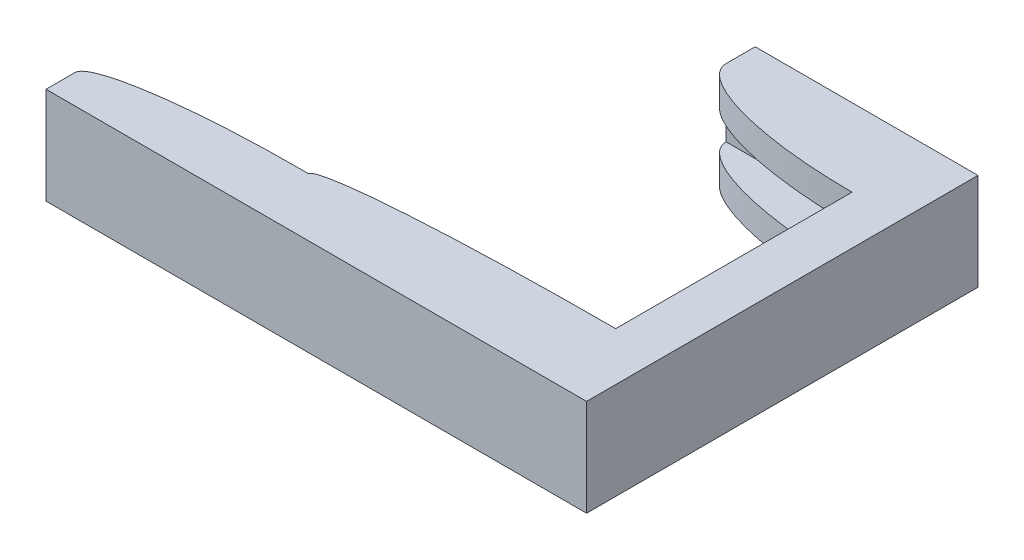
ISO-10303-21;
HEADER;
FILE_DESCRIPTION(('STEP AP214'),'2;1');
FILE_NAME('part.step','',(''),(''),'','','');
FILE_SCHEMA(('AUTOMOTIVE_DESIGN { 1 0 10303 214 1 1 1 1 }'));
ENDSEC;
DATA;
#1=APPLICATION_CONTEXT('core data for automotive mechanical design processes');
#2=APPLICATION_PROTOCOL_DEFINITION('international standard','automotive_design',2000,#1);
#3=PRODUCT_CONTEXT('',#1,'mechanical');
#4=PRODUCT('Part','Part','',(#3));
#5=PRODUCT_RELATED_PRODUCT_CATEGORY('part','',(#4));
#6=PRODUCT_DEFINITION_FORMATION('','',#4);
#7=PRODUCT_DEFINITION_CONTEXT('part definition',#1,'design');
#8=PRODUCT_DEFINITION('design','',#6,#7);
#9=PRODUCT_DEFINITION_SHAPE('','',#8);
#10=(LENGTH_UNIT() NAMED_UNIT(*) SI_UNIT(.MILLI.,.METRE.));
#11=(NAMED_UNIT(*) PLANE_ANGLE_UNIT() SI_UNIT($,.RADIAN.));
#12=(NAMED_UNIT(*) SI_UNIT($,.STERADIAN.) SOLID_ANGLE_UNIT());
#13=UNCERTAINTY_MEASURE_WITH_UNIT(LENGTH_MEASURE(1.E-05),#10,'distance_accuracy_value','');
#14=(GEOMETRIC_REPRESENTATION_CONTEXT(3) GLOBAL_UNCERTAINTY_ASSIGNED_CONTEXT((#13)) GLOBAL_UNIT_ASSIGNED_CONTEXT((#10,
#11,#12)) REPRESENTATION_CONTEXT('',''));
#15=CARTESIAN_POINT('',(0.,0.,0.));
#16=DIRECTION('',(0.,0.,1.));
#17=DIRECTION('',(1.,0.,0.));
#18=AXIS2_PLACEMENT_3D('',#15,#16,#17);
#19=CARTESIAN_POINT('',(-59.2757644968321,-0.15,32.3090395358832));
#20=CARTESIAN_POINT('',(-59.2757644968321,0.450000000000001,32.3090395358832));
#21=CARTESIAN_POINT('',(-59.2757644968321,1.05,32.3090395358832));
#22=CARTESIAN_POINT('',(-59.2757644968321,1.65,32.3090395358832));
#23=CARTESIAN_POINT('',(-69.2757644968321,-0.15,32.3090395358832));
#24=CARTESIAN_POINT('',(-69.2757644968321,0.45,32.3090395358832));
#25=CARTESIAN_POINT('',(-69.2757644968321,1.05,32.3090395358832));
#26=CARTESIAN_POINT('',(-69.2757644968321,1.65,32.3090395358832));
#27=CARTESIAN_POINT('',(-69.2757644968321,-0.15,33.8090395358832));
#28=CARTESIAN_POINT('',(-69.2757644968321,0.450000000000001,33.8090395358832));
#29=CARTESIAN_POINT('',(-69.2757644968321,1.05,33.8090395358832));
#30=CARTESIAN_POINT('',(-69.2757644968321,1.65,33.8090395358832));
#31=(BOUNDED_SURFACE() B_SPLINE_SURFACE(2,3,((#19,#20,#21,#22),(#23,#24,#25,#26),(#27,#28,#29,
#30)),.UNSPECIFIED.,.F.,.F.,.F.) B_SPLINE_SURFACE_WITH_KNOTS((3,3),(4,4),(0.,1.),(-0.00015,
0.00165),.UNSPECIFIED.) GEOMETRIC_REPRESENTATION_ITEM() RATIONAL_B_SPLINE_SURFACE(((1.,1.,1.,
1.),(0.707106781186548,0.707106781186548,0.707106781186548,0.707106781186548),(1.,1.,1.,1.))) REPRESENTATION_ITEM('') SURFACE());
#32=CARTESIAN_POINT('',(-59.2757644968321,1.65,32.3090395358832));
#33=CARTESIAN_POINT('',(-59.2757644968321,1.05,32.3090395358832));
#34=CARTESIAN_POINT('',(-59.2757644968321,0.450000000000001,32.3090395358832));
#35=CARTESIAN_POINT('',(-59.2757644968321,-0.15,32.3090395358832));
#36=(BOUNDED_CURVE() B_SPLINE_CURVE(3,(#32,#33,#34,#35),.UNSPECIFIED.,.F.,
.F.) B_SPLINE_CURVE_WITH_KNOTS((4,4),(-0.00015,0.00165),
.UNSPECIFIED.) CURVE() GEOMETRIC_REPRESENTATION_ITEM() RATIONAL_B_SPLINE_CURVE((1.,1.,1.,1.)) REPRESENTATION_ITEM(''));
#37=CARTESIAN_POINT('',(-59.2757644968321,0.,32.3090395358832));
#38=VERTEX_POINT('',#37);
#39=CARTESIAN_POINT('',(-59.2757644968321,1.5,32.3090395358832));
#40=VERTEX_POINT('',#39);
#41=EDGE_CURVE('E393',#38,#40,#36,.F.);
#42=CARTESIAN_POINT('',(-59.2757644968321,0.,32.3090395358832));
#43=CARTESIAN_POINT('',(-69.2757644968321,0.,32.3090395358832));
#44=CARTESIAN_POINT('',(-69.2757644968321,0.,33.8090395358832));
#45=(BOUNDED_CURVE() B_SPLINE_CURVE(2,(#42,#43,#44),.UNSPECIFIED.,.F.,
.F.) B_SPLINE_CURVE_WITH_KNOTS((3,3),(0.,1.),
.UNSPECIFIED.) CURVE() GEOMETRIC_REPRESENTATION_ITEM() RATIONAL_B_SPLINE_CURVE((1.,
0.707106781186548,1.)) REPRESENTATION_ITEM(''));
#46=CARTESIAN_POINT('',(-69.2757644968321,0.,33.8090395358832));
#47=VERTEX_POINT('',#46);
#48=EDGE_CURVE('E51',#47,#38,#45,.F.);
#49=CARTESIAN_POINT('',(-69.2757644968321,-0.15,33.8090395358832));
#50=CARTESIAN_POINT('',(-69.2757644968321,0.450000000000001,33.8090395358832));
#51=CARTESIAN_POINT('',(-69.2757644968321,1.05,33.8090395358832));
#52=CARTESIAN_POINT('',(-69.2757644968321,1.65,33.8090395358832));
#53=(BOUNDED_CURVE() B_SPLINE_CURVE(3,(#49,#50,#51,#52),.UNSPECIFIED.,.F.,
.F.) B_SPLINE_CURVE_WITH_KNOTS((4,4),(-0.00015,0.00165),
.UNSPECIFIED.) CURVE() GEOMETRIC_REPRESENTATION_ITEM() RATIONAL_B_SPLINE_CURVE((1.,1.,1.,1.)) REPRESENTATION_ITEM(''));
#54=CARTESIAN_POINT('',(-69.2757644968321,1.5,33.8090395358832));
#55=VERTEX_POINT('',#54);
#56=EDGE_CURVE('E404',#55,#47,#53,.F.);
#57=CARTESIAN_POINT('',(-69.2757644968321,1.5,33.8090395358832));
#58=CARTESIAN_POINT('',(-69.2757644968321,1.5,32.3090395358832));
#59=CARTESIAN_POINT('',(-59.2757644968321,1.5,32.3090395358832));
#60=(BOUNDED_CURVE() B_SPLINE_CURVE(2,(#57,#58,#59),.UNSPECIFIED.,.F.,
.F.) B_SPLINE_CURVE_WITH_KNOTS((3,3),(0.,1.),
.UNSPECIFIED.) CURVE() GEOMETRIC_REPRESENTATION_ITEM() RATIONAL_B_SPLINE_CURVE((1.,
0.707106781186547,1.)) REPRESENTATION_ITEM(''));
#61=EDGE_CURVE('E12',#40,#55,#60,.F.);
#62=ORIENTED_EDGE('',*,*,#41,.F.);
#63=ORIENTED_EDGE('',*,*,#48,.F.);
#64=ORIENTED_EDGE('',*,*,#56,.F.);
#65=ORIENTED_EDGE('',*,*,#61,.F.);
#66=EDGE_LOOP('',(#62,#63,#64,#65));
#67=FACE_BOUND('',#66,.T.);
#68=ADVANCED_FACE('F38',(#67),#31,.T.);
#69=CARTESIAN_POINT('',(-59.2757644968321,3.35,32.3090395358832));
#70=CARTESIAN_POINT('',(-59.2757644968321,3.95,32.3090395358832));
#71=CARTESIAN_POINT('',(-59.2757644968321,4.55,32.3090395358832));
#72=CARTESIAN_POINT('',(-59.2757644968321,5.15,32.3090395358832));
#73=CARTESIAN_POINT('',(-69.2757644968321,3.35,32.3090395358832));
#74=CARTESIAN_POINT('',(-69.2757644968321,3.95,32.3090395358832));
#75=CARTESIAN_POINT('',(-69.2757644968321,4.55,32.3090395358832));
#76=CARTESIAN_POINT('',(-69.2757644968321,5.15,32.3090395358832));
#77=CARTESIAN_POINT('',(-69.2757644968321,3.35,33.8090395358832));
#78=CARTESIAN_POINT('',(-69.2757644968321,3.95,33.8090395358832));
#79=CARTESIAN_POINT('',(-69.2757644968321,4.55,33.8090395358832));
#80=CARTESIAN_POINT('',(-69.2757644968321,5.15,33.8090395358832));
#81=(BOUNDED_SURFACE() B_SPLINE_SURFACE(2,3,((#69,#70,#71,#72),(#73,#74,#75,#76),(#77,#78,#79,
#80)),.UNSPECIFIED.,.F.,.F.,.F.) B_SPLINE_SURFACE_WITH_KNOTS((3,3),(4,4),(0.,1.),(0.00335,
0.00515),.UNSPECIFIED.) GEOMETRIC_REPRESENTATION_ITEM() RATIONAL_B_SPLINE_SURFACE(((1.,1.,1.,
1.),(0.707106781186548,0.707106781186548,0.707106781186548,0.707106781186548),(1.,1.,1.,1.))) REPRESENTATION_ITEM('') SURFACE());
#82=CARTESIAN_POINT('',(-59.2757644968321,5.15,32.3090395358832));
#83=CARTESIAN_POINT('',(-59.2757644968321,4.55,32.3090395358832));
#84=CARTESIAN_POINT('',(-59.2757644968321,3.95,32.3090395358832));
#85=CARTESIAN_POINT('',(-59.2757644968321,3.35,32.3090395358832));
#86=(BOUNDED_CURVE() B_SPLINE_CURVE(3,(#82,#83,#84,#85),.UNSPECIFIED.,.F.,
.F.) B_SPLINE_CURVE_WITH_KNOTS((4,4),(0.00335,0.00515),
.UNSPECIFIED.) CURVE() GEOMETRIC_REPRESENTATION_ITEM() RATIONAL_B_SPLINE_CURVE((1.,1.,1.,1.)) REPRESENTATION_ITEM(''));
#87=CARTESIAN_POINT('',(-59.2757644968321,3.5,32.3090395358832));
#88=VERTEX_POINT('',#87);
#89=CARTESIAN_POINT('',(-59.2757644968321,5.,32.3090395358832));
#90=VERTEX_POINT('',#89);
#91=EDGE_CURVE('E431',#88,#90,#86,.F.);
#92=CARTESIAN_POINT('',(-59.2757644968321,3.5,32.3090395358832));
#93=CARTESIAN_POINT('',(-69.2757644968321,3.5,32.3090395358832));
#94=CARTESIAN_POINT('',(-69.2757644968321,3.5,33.8090395358832));
#95=(BOUNDED_CURVE() B_SPLINE_CURVE(2,(#92,#93,#94),.UNSPECIFIED.,.F.,
.F.) B_SPLINE_CURVE_WITH_KNOTS((3,3),(0.,1.),
.UNSPECIFIED.) CURVE() GEOMETRIC_REPRESENTATION_ITEM() RATIONAL_B_SPLINE_CURVE((1.,
0.707106781186548,1.)) REPRESENTATION_ITEM(''));
#96=CARTESIAN_POINT('',(-69.2757644968321,3.5,33.8090395358832));
#97=VERTEX_POINT('',#96);
#98=EDGE_CURVE('E769',#97,#88,#95,.F.);
#99=CARTESIAN_POINT('',(-69.2757644968321,3.35,33.8090395358832));
#100=CARTESIAN_POINT('',(-69.2757644968321,3.95,33.8090395358832));
#101=CARTESIAN_POINT('',(-69.2757644968321,4.55,33.8090395358832));
#102=CARTESIAN_POINT('',(-69.2757644968321,5.15,33.8090395358832));
#103=(BOUNDED_CURVE() B_SPLINE_CURVE(3,(#99,#100,#101,#102),.UNSPECIFIED.,.F.,
.F.) B_SPLINE_CURVE_WITH_KNOTS((4,4),(0.00335,0.00515),
.UNSPECIFIED.) CURVE() GEOMETRIC_REPRESENTATION_ITEM() RATIONAL_B_SPLINE_CURVE((1.,1.,1.,1.)) REPRESENTATION_ITEM(''));
#104=CARTESIAN_POINT('',(-69.2757644968321,5.,33.8090395358832));
#105=VERTEX_POINT('',#104);
#106=EDGE_CURVE('E758',#105,#97,#103,.F.);
#107=CARTESIAN_POINT('',(-69.2757644968321,5.,33.8090395358832));
#108=CARTESIAN_POINT('',(-69.2757644968321,5.,32.3090395358832));
#109=CARTESIAN_POINT('',(-59.2757644968321,5.,32.3090395358832));
#110=(BOUNDED_CURVE() B_SPLINE_CURVE(2,(#107,#108,#109),.UNSPECIFIED.,.F.,
.F.) B_SPLINE_CURVE_WITH_KNOTS((3,3),(0.,1.),
.UNSPECIFIED.) CURVE() GEOMETRIC_REPRESENTATION_ITEM() RATIONAL_B_SPLINE_CURVE((1.,
0.707106781186548,1.)) REPRESENTATION_ITEM(''));
#111=EDGE_CURVE('E423',#90,#105,#110,.F.);
#112=ORIENTED_EDGE('',*,*,#91,.F.);
#113=ORIENTED_EDGE('',*,*,#98,.F.);
#114=ORIENTED_EDGE('',*,*,#106,.F.);
#115=ORIENTED_EDGE('',*,*,#111,.F.);
#116=EDGE_LOOP('',(#112,#113,#114,#115));
#117=FACE_BOUND('',#116,.T.);
#118=ADVANCED_FACE('F464',(#117),#81,.T.);
#119=CARTESIAN_POINT('',(-44.2198376061391,-0.15,31.3090395358832));
#120=CARTESIAN_POINT('',(-44.2198376061391,0.450000000000001,31.3090395358832));
#121=CARTESIAN_POINT('',(-44.2198376061391,1.05,31.3090395358832));
#122=CARTESIAN_POINT('',(-44.2198376061391,1.65,31.3090395358832));
#123=CARTESIAN_POINT('',(-58.7198376061391,-0.15,31.3090395358831));
#124=CARTESIAN_POINT('',(-58.7198376061391,0.45,31.3090395358831));
#125=CARTESIAN_POINT('',(-58.7198376061391,1.05,31.3090395358831));
#126=CARTESIAN_POINT('',(-58.7198376061391,1.65,31.3090395358831));
#127=CARTESIAN_POINT('',(-58.7198376061391,-0.15,32.3090395358832));
#128=CARTESIAN_POINT('',(-58.7198376061391,0.450000000000001,32.3090395358832));
#129=CARTESIAN_POINT('',(-58.7198376061391,1.05,32.3090395358832));
#130=CARTESIAN_POINT('',(-58.7198376061391,1.65,32.3090395358832));
#131=(BOUNDED_SURFACE() B_SPLINE_SURFACE(2,3,((#119,#120,#121,#122),(#123,#124,#125,#126),(#127,
#128,#129,#130)),.UNSPECIFIED.,.F.,.F.,.F.) B_SPLINE_SURFACE_WITH_KNOTS((3,3),(4,4),(0.,1.),
(-0.00015,0.00165),
.UNSPECIFIED.) GEOMETRIC_REPRESENTATION_ITEM() RATIONAL_B_SPLINE_SURFACE(((1.,1.,1.,1.),
(0.707106781186545,0.707106781186545,0.707106781186545,0.707106781186545),(1.,1.,1.,1.))) REPRESENTATION_ITEM('') SURFACE());
#132=CARTESIAN_POINT('',(-44.2198376061391,1.65,31.3090395358832));
#133=CARTESIAN_POINT('',(-44.2198376061391,1.05,31.3090395358832));
#134=CARTESIAN_POINT('',(-44.2198376061391,0.450000000000001,31.3090395358832));
#135=CARTESIAN_POINT('',(-44.2198376061391,-0.15,31.3090395358832));
#136=(BOUNDED_CURVE() B_SPLINE_CURVE(3,(#132,#133,#134,#135),.UNSPECIFIED.,.F.,
.F.) B_SPLINE_CURVE_WITH_KNOTS((4,4),(-0.00015,0.00165),
.UNSPECIFIED.) CURVE() GEOMETRIC_REPRESENTATION_ITEM() RATIONAL_B_SPLINE_CURVE((1.,1.,1.,1.)) REPRESENTATION_ITEM(''));
#137=CARTESIAN_POINT('',(-44.2198376061391,0.,31.3090395358832));
#138=VERTEX_POINT('',#137);
#139=CARTESIAN_POINT('',(-44.2198376061391,1.5,31.3090395358832));
#140=VERTEX_POINT('',#139);
#141=EDGE_CURVE('E674',#138,#140,#136,.F.);
#142=CARTESIAN_POINT('',(-44.2198376061391,0.,31.3090395358832));
#143=CARTESIAN_POINT('',(-58.7198376061391,0.,31.3090395358831));
#144=CARTESIAN_POINT('',(-58.7198376061391,0.,32.3090395358832));
#145=(BOUNDED_CURVE() B_SPLINE_CURVE(2,(#142,#143,#144),.UNSPECIFIED.,.F.,
.F.) B_SPLINE_CURVE_WITH_KNOTS((3,3),(0.,1.),
.UNSPECIFIED.) CURVE() GEOMETRIC_REPRESENTATION_ITEM() RATIONAL_B_SPLINE_CURVE((1.,
0.707106781186545,1.)) REPRESENTATION_ITEM(''));
#146=CARTESIAN_POINT('',(-58.7198376061391,0.,32.3090395358832));
#147=VERTEX_POINT('',#146);
#148=EDGE_CURVE('E432',#147,#138,#145,.F.);
#149=CARTESIAN_POINT('',(-58.7198376061391,-0.15,32.3090395358832));
#150=CARTESIAN_POINT('',(-58.7198376061391,0.450000000000001,32.3090395358832));
#151=CARTESIAN_POINT('',(-58.7198376061391,1.05,32.3090395358832));
#152=CARTESIAN_POINT('',(-58.7198376061391,1.65,32.3090395358832));
#153=(BOUNDED_CURVE() B_SPLINE_CURVE(3,(#149,#150,#151,#152),.UNSPECIFIED.,.F.,
.F.) B_SPLINE_CURVE_WITH_KNOTS((4,4),(-0.00015,0.00165),
.UNSPECIFIED.) CURVE() GEOMETRIC_REPRESENTATION_ITEM() RATIONAL_B_SPLINE_CURVE((1.,1.,1.,1.)) REPRESENTATION_ITEM(''));
#154=CARTESIAN_POINT('',(-58.7198376061391,1.5,32.3090395358832));
#155=VERTEX_POINT('',#154);
#156=EDGE_CURVE('E434',#147,#155,#153,.T.);
#157=CARTESIAN_POINT('',(-58.7198376061391,1.5,32.3090395358832));
#158=CARTESIAN_POINT('',(-58.7198376061391,1.5,31.3090395358831));
#159=CARTESIAN_POINT('',(-44.2198376061391,1.5,31.3090395358832));
#160=(BOUNDED_CURVE() B_SPLINE_CURVE(2,(#157,#158,#159),.UNSPECIFIED.,.F.,
.F.) B_SPLINE_CURVE_WITH_KNOTS((3,3),(0.,1.),
.UNSPECIFIED.) CURVE() GEOMETRIC_REPRESENTATION_ITEM() RATIONAL_B_SPLINE_CURVE((1.,
0.707106781186545,1.)) REPRESENTATION_ITEM(''));
#161=EDGE_CURVE('E425',#140,#155,#160,.F.);
#162=ORIENTED_EDGE('',*,*,#141,.F.);
#163=ORIENTED_EDGE('',*,*,#148,.F.);
#164=ORIENTED_EDGE('',*,*,#156,.T.);
#165=ORIENTED_EDGE('',*,*,#161,.F.);
#166=EDGE_LOOP('',(#162,#163,#164,#165));
#167=FACE_BOUND('',#166,.T.);
#168=ADVANCED_FACE('F436',(#167),#131,.T.);
#169=CARTESIAN_POINT('',(-44.2198376061391,3.35,31.3090395358832));
#170=CARTESIAN_POINT('',(-44.2198376061391,3.95,31.3090395358832));
#171=CARTESIAN_POINT('',(-44.2198376061391,4.55,31.3090395358832));
#172=CARTESIAN_POINT('',(-44.2198376061391,5.15,31.3090395358832));
#173=CARTESIAN_POINT('',(-58.7198376061391,3.35,31.3090395358831));
#174=CARTESIAN_POINT('',(-58.7198376061391,3.95,31.3090395358831));
#175=CARTESIAN_POINT('',(-58.7198376061391,4.55,31.3090395358831));
#176=CARTESIAN_POINT('',(-58.7198376061391,5.15,31.3090395358831));
#177=CARTESIAN_POINT('',(-58.7198376061391,3.35,32.3090395358832));
#178=CARTESIAN_POINT('',(-58.7198376061391,3.95,32.3090395358832));
#179=CARTESIAN_POINT('',(-58.7198376061391,4.55,32.3090395358832));
#180=CARTESIAN_POINT('',(-58.7198376061391,5.15,32.3090395358832));
#181=(BOUNDED_SURFACE() B_SPLINE_SURFACE(2,3,((#169,#170,#171,#172),(#173,#174,#175,#176),(#177,
#178,#179,#180)),.UNSPECIFIED.,.F.,.F.,.F.) B_SPLINE_SURFACE_WITH_KNOTS((3,3),(4,4),(0.,1.),
(0.00335,0.00515),.UNSPECIFIED.) GEOMETRIC_REPRESENTATION_ITEM() RATIONAL_B_SPLINE_SURFACE(((1.,
1.,1.,1.),(0.707106781186545,0.707106781186545,0.707106781186545,0.707106781186545),(1.,1.,1.,1.))) REPRESENTATION_ITEM('') SURFACE());
#182=CARTESIAN_POINT('',(-44.2198376061391,5.15,31.3090395358832));
#183=CARTESIAN_POINT('',(-44.2198376061391,4.55,31.3090395358832));
#184=CARTESIAN_POINT('',(-44.2198376061391,3.95,31.3090395358832));
#185=CARTESIAN_POINT('',(-44.2198376061391,3.35,31.3090395358832));
#186=(BOUNDED_CURVE() B_SPLINE_CURVE(3,(#182,#183,#184,#185),.UNSPECIFIED.,.F.,
.F.) B_SPLINE_CURVE_WITH_KNOTS((4,4),(0.00335,0.00515),
.UNSPECIFIED.) CURVE() GEOMETRIC_REPRESENTATION_ITEM() RATIONAL_B_SPLINE_CURVE((1.,1.,1.,1.)) REPRESENTATION_ITEM(''));
#187=CARTESIAN_POINT('',(-44.2198376061391,3.5,31.3090395358832));
#188=VERTEX_POINT('',#187);
#189=CARTESIAN_POINT('',(-44.2198376061391,5.,31.3090395358832));
#190=VERTEX_POINT('',#189);
#191=EDGE_CURVE('E655',#188,#190,#186,.F.);
#192=CARTESIAN_POINT('',(-44.2198376061391,3.5,31.3090395358832));
#193=CARTESIAN_POINT('',(-58.7198376061391,3.5,31.3090395358831));
#194=CARTESIAN_POINT('',(-58.7198376061391,3.5,32.3090395358832));
#195=(BOUNDED_CURVE() B_SPLINE_CURVE(2,(#192,#193,#194),.UNSPECIFIED.,.F.,
.F.) B_SPLINE_CURVE_WITH_KNOTS((3,3),(0.,1.),
.UNSPECIFIED.) CURVE() GEOMETRIC_REPRESENTATION_ITEM() RATIONAL_B_SPLINE_CURVE((1.,
0.707106781186545,1.)) REPRESENTATION_ITEM(''));
#196=CARTESIAN_POINT('',(-58.7198376061391,3.5,32.3090395358832));
#197=VERTEX_POINT('',#196);
#198=EDGE_CURVE('E700',#197,#188,#195,.F.);
#199=CARTESIAN_POINT('',(-58.7198376061391,3.35,32.3090395358832));
#200=CARTESIAN_POINT('',(-58.7198376061391,3.95,32.3090395358832));
#201=CARTESIAN_POINT('',(-58.7198376061391,4.55,32.3090395358832));
#202=CARTESIAN_POINT('',(-58.7198376061391,5.15,32.3090395358832));
#203=(BOUNDED_CURVE() B_SPLINE_CURVE(3,(#199,#200,#201,#202),.UNSPECIFIED.,.F.,
.F.) B_SPLINE_CURVE_WITH_KNOTS((4,4),(0.00335,0.00515),
.UNSPECIFIED.) CURVE() GEOMETRIC_REPRESENTATION_ITEM() RATIONAL_B_SPLINE_CURVE((1.,1.,1.,1.)) REPRESENTATION_ITEM(''));
#204=CARTESIAN_POINT('',(-58.7198376061391,5.,32.3090395358832));
#205=VERTEX_POINT('',#204);
#206=EDGE_CURVE('E440',#197,#205,#203,.T.);
#207=CARTESIAN_POINT('',(-58.7198376061391,5.,32.3090395358832));
#208=CARTESIAN_POINT('',(-58.7198376061391,5.,31.3090395358831));
#209=CARTESIAN_POINT('',(-44.2198376061391,5.,31.3090395358832));
#210=(BOUNDED_CURVE() B_SPLINE_CURVE(2,(#207,#208,#209),.UNSPECIFIED.,.F.,
.F.) B_SPLINE_CURVE_WITH_KNOTS((3,3),(0.,1.),
.UNSPECIFIED.) CURVE() GEOMETRIC_REPRESENTATION_ITEM() RATIONAL_B_SPLINE_CURVE((1.,
0.707106781186545,1.)) REPRESENTATION_ITEM(''));
#211=EDGE_CURVE('E783',#190,#205,#210,.F.);
#212=ORIENTED_EDGE('',*,*,#191,.F.);
#213=ORIENTED_EDGE('',*,*,#198,.F.);
#214=ORIENTED_EDGE('',*,*,#206,.T.);
#215=ORIENTED_EDGE('',*,*,#211,.F.);
#216=EDGE_LOOP('',(#212,#213,#214,#215));
#217=FACE_BOUND('',#216,.T.);
#218=ADVANCED_FACE('F463',(#217),#181,.T.);
#219=CARTESIAN_POINT('',(-43.8757644968321,1.65,19.1090395358832));
#220=CARTESIAN_POINT('',(-43.8757644968321,1.05,19.1090395358832));
#221=CARTESIAN_POINT('',(-43.8757644968321,0.45,19.1090395358832));
#222=CARTESIAN_POINT('',(-43.8757644968321,-0.15,19.1090395358832));
#223=CARTESIAN_POINT('',(-52.8757644968321,1.65,19.1090395358832));
#224=CARTESIAN_POINT('',(-52.8757644968321,1.05,19.1090395358832));
#225=CARTESIAN_POINT('',(-52.8757644968321,0.45,19.1090395358832));
#226=CARTESIAN_POINT('',(-52.8757644968321,-0.15,19.1090395358832));
#227=CARTESIAN_POINT('',(-52.8757644968321,1.65,16.6090395358832));
#228=CARTESIAN_POINT('',(-52.8757644968321,1.05,16.6090395358832));
#229=CARTESIAN_POINT('',(-52.8757644968321,0.45,16.6090395358832));
#230=CARTESIAN_POINT('',(-52.8757644968321,-0.15,16.6090395358832));
#231=(BOUNDED_SURFACE() B_SPLINE_SURFACE(2,3,((#219,#220,#221,#222),(#223,#224,#225,#226),(#227,
#228,#229,#230)),.UNSPECIFIED.,.F.,.F.,.F.) B_SPLINE_SURFACE_WITH_KNOTS((3,3),(4,4),(0.,1.),
(-0.00165,0.00015),
.UNSPECIFIED.) GEOMETRIC_REPRESENTATION_ITEM() RATIONAL_B_SPLINE_SURFACE(((1.,1.,1.,1.),
(0.707106781186548,0.707106781186548,0.707106781186548,0.707106781186548),(1.,1.,1.,1.))) REPRESENTATION_ITEM('') SURFACE());
#232=CARTESIAN_POINT('',(-43.8757644968321,-0.15,19.1090395358832));
#233=CARTESIAN_POINT('',(-43.8757644968321,0.45,19.1090395358832));
#234=CARTESIAN_POINT('',(-43.8757644968321,1.05,19.1090395358832));
#235=CARTESIAN_POINT('',(-43.8757644968321,1.65,19.1090395358832));
#236=(BOUNDED_CURVE() B_SPLINE_CURVE(3,(#232,#233,#234,#235),.UNSPECIFIED.,.F.,
.F.) B_SPLINE_CURVE_WITH_KNOTS((4,4),(-0.00165,0.00015),
.UNSPECIFIED.) CURVE() GEOMETRIC_REPRESENTATION_ITEM() RATIONAL_B_SPLINE_CURVE((1.,1.,1.,1.)) REPRESENTATION_ITEM(''));
#237=CARTESIAN_POINT('',(-43.8757644968321,0.,19.1090395358832));
#238=VERTEX_POINT('',#237);
#239=CARTESIAN_POINT('',(-43.8757644968321,1.5,19.1090395358832));
#240=VERTEX_POINT('',#239);
#241=EDGE_CURVE('E651',#238,#240,#236,.T.);
#242=CARTESIAN_POINT('',(-43.8757644968321,1.5,19.1090395358832));
#243=CARTESIAN_POINT('',(-52.8757644968321,1.5,19.1090395358832));
#244=CARTESIAN_POINT('',(-52.8757644968321,1.5,16.6090395358832));
#245=(BOUNDED_CURVE() B_SPLINE_CURVE(2,(#242,#243,#244),.UNSPECIFIED.,.F.,
.F.) B_SPLINE_CURVE_WITH_KNOTS((3,3),(0.,1.),
.UNSPECIFIED.) CURVE() GEOMETRIC_REPRESENTATION_ITEM() RATIONAL_B_SPLINE_CURVE((1.,
0.707106781186548,1.)) REPRESENTATION_ITEM(''));
#246=CARTESIAN_POINT('',(-52.8757644968321,1.5,16.6090395358832));
#247=VERTEX_POINT('',#246);
#248=EDGE_CURVE('E294',#247,#240,#245,.F.);
#249=CARTESIAN_POINT('',(-52.8757644968321,1.65,16.6090395358832));
#250=CARTESIAN_POINT('',(-52.8757644968321,1.05,16.6090395358832));
#251=CARTESIAN_POINT('',(-52.8757644968321,0.45,16.6090395358832));
#252=CARTESIAN_POINT('',(-52.8757644968321,-0.15,16.6090395358832));
#253=(BOUNDED_CURVE() B_SPLINE_CURVE(3,(#249,#250,#251,#252),.UNSPECIFIED.,.F.,
.F.) B_SPLINE_CURVE_WITH_KNOTS((4,4),(-0.00165,0.00015),
.UNSPECIFIED.) CURVE() GEOMETRIC_REPRESENTATION_ITEM() RATIONAL_B_SPLINE_CURVE((1.,1.,1.,1.)) REPRESENTATION_ITEM(''));
#254=CARTESIAN_POINT('',(-52.8757644968321,0.,16.6090395358832));
#255=VERTEX_POINT('',#254);
#256=EDGE_CURVE('E652',#255,#247,#253,.F.);
#257=CARTESIAN_POINT('',(-52.8757644968321,0.,16.6090395358832));
#258=CARTESIAN_POINT('',(-52.8757644968321,0.,19.1090395358832));
#259=CARTESIAN_POINT('',(-43.8757644968321,0.,19.1090395358832));
#260=(BOUNDED_CURVE() B_SPLINE_CURVE(2,(#257,#258,#259),.UNSPECIFIED.,.F.,
.F.) B_SPLINE_CURVE_WITH_KNOTS((3,3),(0.,1.),
.UNSPECIFIED.) CURVE() GEOMETRIC_REPRESENTATION_ITEM() RATIONAL_B_SPLINE_CURVE((1.,
0.707106781186548,1.)) REPRESENTATION_ITEM(''));
#261=EDGE_CURVE('E649',#238,#255,#260,.F.);
#262=ORIENTED_EDGE('',*,*,#241,.T.);
#263=ORIENTED_EDGE('',*,*,#248,.F.);
#264=ORIENTED_EDGE('',*,*,#256,.F.);
#265=ORIENTED_EDGE('',*,*,#261,.F.);
#266=EDGE_LOOP('',(#262,#263,#264,#265));
#267=FACE_BOUND('',#266,.T.);
#268=ADVANCED_FACE('F571',(#267),#231,.T.);
#269=CARTESIAN_POINT('',(-43.8757644968321,5.15,19.1090395358832));
#270=CARTESIAN_POINT('',(-43.8757644968321,4.55000000000001,19.1090395358832));
#271=CARTESIAN_POINT('',(-43.8757644968321,3.94999999999999,19.1090395358832));
#272=CARTESIAN_POINT('',(-43.8757644968321,3.35,19.1090395358832));
#273=CARTESIAN_POINT('',(-52.8757644968321,5.15,19.1090395358832));
#274=CARTESIAN_POINT('',(-52.8757644968321,4.55000000000001,19.1090395358832));
#275=CARTESIAN_POINT('',(-52.8757644968321,3.94999999999999,19.1090395358832));
#276=CARTESIAN_POINT('',(-52.8757644968321,3.35,19.1090395358832));
#277=CARTESIAN_POINT('',(-52.8757644968321,5.15,16.6090395358832));
#278=CARTESIAN_POINT('',(-52.8757644968321,4.55000000000001,16.6090395358832));
#279=CARTESIAN_POINT('',(-52.8757644968321,3.94999999999999,16.6090395358832));
#280=CARTESIAN_POINT('',(-52.8757644968321,3.35,16.6090395358832));
#281=(BOUNDED_SURFACE() B_SPLINE_SURFACE(2,3,((#269,#270,#271,#272),(#273,#274,#275,#276),(#277,
#278,#279,#280)),.UNSPECIFIED.,.F.,.F.,.F.) B_SPLINE_SURFACE_WITH_KNOTS((3,3),(4,4),(0.,1.),
(-0.00515,-0.00335),
.UNSPECIFIED.) GEOMETRIC_REPRESENTATION_ITEM() RATIONAL_B_SPLINE_SURFACE(((1.,1.,1.,1.),
(0.707106781186548,0.707106781186548,0.707106781186548,0.707106781186548),(1.,1.,1.,1.))) REPRESENTATION_ITEM('') SURFACE());
#282=CARTESIAN_POINT('',(-43.8757644968321,3.35,19.1090395358832));
#283=CARTESIAN_POINT('',(-43.8757644968321,3.94999999999999,19.1090395358832));
#284=CARTESIAN_POINT('',(-43.8757644968321,4.55000000000001,19.1090395358832));
#285=CARTESIAN_POINT('',(-43.8757644968321,5.15,19.1090395358832));
#286=(BOUNDED_CURVE() B_SPLINE_CURVE(3,(#282,#283,#284,#285),.UNSPECIFIED.,.F.,
.F.) B_SPLINE_CURVE_WITH_KNOTS((4,4),(-0.00515,-0.00335),
.UNSPECIFIED.) CURVE() GEOMETRIC_REPRESENTATION_ITEM() RATIONAL_B_SPLINE_CURVE((1.,1.,1.,1.)) REPRESENTATION_ITEM(''));
#287=CARTESIAN_POINT('',(-43.8757644968321,3.5,19.1090395358832));
#288=VERTEX_POINT('',#287);
#289=CARTESIAN_POINT('',(-43.8757644968321,5.,19.1090395358832));
#290=VERTEX_POINT('',#289);
#291=EDGE_CURVE('E661',#288,#290,#286,.T.);
#292=CARTESIAN_POINT('',(-43.8757644968321,5.,19.1090395358832));
#293=CARTESIAN_POINT('',(-52.8757644968321,5.,19.1090395358832));
#294=CARTESIAN_POINT('',(-52.8757644968321,5.,16.6090395358832));
#295=(BOUNDED_CURVE() B_SPLINE_CURVE(2,(#292,#293,#294),.UNSPECIFIED.,.F.,
.F.) B_SPLINE_CURVE_WITH_KNOTS((3,3),(0.,1.),
.UNSPECIFIED.) CURVE() GEOMETRIC_REPRESENTATION_ITEM() RATIONAL_B_SPLINE_CURVE((1.,
0.707106781186548,1.)) REPRESENTATION_ITEM(''));
#296=CARTESIAN_POINT('',(-52.8757644968321,5.,16.6090395358832));
#297=VERTEX_POINT('',#296);
#298=EDGE_CURVE('E840',#297,#290,#295,.F.);
#299=CARTESIAN_POINT('',(-52.8757644968321,5.15,16.6090395358832));
#300=CARTESIAN_POINT('',(-52.8757644968321,4.55000000000001,16.6090395358832));
#301=CARTESIAN_POINT('',(-52.8757644968321,3.94999999999999,16.6090395358832));
#302=CARTESIAN_POINT('',(-52.8757644968321,3.35,16.6090395358832));
#303=(BOUNDED_CURVE() B_SPLINE_CURVE(3,(#299,#300,#301,#302),.UNSPECIFIED.,.F.,
.F.) B_SPLINE_CURVE_WITH_KNOTS((4,4),(-0.00515,-0.00335),
.UNSPECIFIED.) CURVE() GEOMETRIC_REPRESENTATION_ITEM() RATIONAL_B_SPLINE_CURVE((1.,1.,1.,1.)) REPRESENTATION_ITEM(''));
#304=CARTESIAN_POINT('',(-52.8757644968321,3.5,16.6090395358832));
#305=VERTEX_POINT('',#304);
#306=EDGE_CURVE('E251',#305,#297,#303,.F.);
#307=CARTESIAN_POINT('',(-52.8757644968321,3.5,16.6090395358832));
#308=CARTESIAN_POINT('',(-52.8757644968321,3.5,19.1090395358832));
#309=CARTESIAN_POINT('',(-43.8757644968321,3.5,19.1090395358832));
#310=(BOUNDED_CURVE() B_SPLINE_CURVE(2,(#307,#308,#309),.UNSPECIFIED.,.F.,
.F.) B_SPLINE_CURVE_WITH_KNOTS((3,3),(0.,1.),
.UNSPECIFIED.) CURVE() GEOMETRIC_REPRESENTATION_ITEM() RATIONAL_B_SPLINE_CURVE((1.,
0.707106781186548,1.)) REPRESENTATION_ITEM(''));
#311=EDGE_CURVE('E852',#288,#305,#310,.F.);
#312=ORIENTED_EDGE('',*,*,#291,.T.);
#313=ORIENTED_EDGE('',*,*,#298,.F.);
#314=ORIENTED_EDGE('',*,*,#306,.F.);
#315=ORIENTED_EDGE('',*,*,#311,.F.);
#316=EDGE_LOOP('',(#312,#313,#314,#315));
#317=FACE_BOUND('',#316,.T.);
#318=ADVANCED_FACE('F585',(#317),#281,.T.);
#319=CARTESIAN_POINT('',(-43.8757644968321,0.,31.3090395358832));
#320=DIRECTION('',(1.,0.,0.));
#321=DIRECTION('',(0.,0.,-1.));
#322=AXIS2_PLACEMENT_3D('',#319,#320,#321);
#323=PLANE('',#322);
#324=DIRECTION('',(0.,1.,0.));
#325=VECTOR('',#324,1.);
#326=CARTESIAN_POINT('',(-43.8757644968321,0.,31.3090395358832));
#327=LINE('',#326,#325);
#328=CARTESIAN_POINT('',(-43.8757644968321,0.,31.3090395358832));
#329=VERTEX_POINT('',#328);
#330=CARTESIAN_POINT('',(-43.8757644968321,1.5,31.3090395358832));
#331=VERTEX_POINT('',#330);
#332=EDGE_CURVE('E937',#329,#331,#327,.T.);
#333=ORIENTED_EDGE('',*,*,#332,.T.);
#334=DIRECTION('',(0.,0.,-1.));
#335=VECTOR('',#334,1.);
#336=CARTESIAN_POINT('',(-43.8757644968321,1.5,31.3090395358832));
#337=LINE('',#336,#335);
#338=EDGE_CURVE('E300',#331,#240,#337,.T.);
#339=ORIENTED_EDGE('',*,*,#338,.T.);
#340=ORIENTED_EDGE('',*,*,#241,.F.);
#341=DIRECTION('',(0.,0.,-1.));
#342=VECTOR('',#341,1.);
#343=CARTESIAN_POINT('',(-43.8757644968321,0.,31.3090395358832));
#344=LINE('',#343,#342);
#345=EDGE_CURVE('E660',#329,#238,#344,.T.);
#346=ORIENTED_EDGE('',*,*,#345,.F.);
#347=EDGE_LOOP('',(#333,#339,#340,#346));
#348=FACE_BOUND('',#347,.T.);
#349=ADVANCED_FACE('F659',(#348),#323,.F.);
#350=CARTESIAN_POINT('',(-58.7198376061391,0.,31.3090395358832));
#351=DIRECTION('',(0.,0.,1.));
#352=DIRECTION('',(1.,0.,0.));
#353=AXIS2_PLACEMENT_3D('',#350,#351,#352);
#354=PLANE('',#353);
#355=DIRECTION('',(1.,0.,0.));
#356=VECTOR('',#355,1.);
#357=CARTESIAN_POINT('',(-58.7198376061391,0.,31.3090395358832));
#358=LINE('',#357,#356);
#359=EDGE_CURVE('E342',#138,#329,#358,.T.);
#360=ORIENTED_EDGE('',*,*,#359,.F.);
#361=ORIENTED_EDGE('',*,*,#141,.T.);
#362=DIRECTION('',(1.,0.,0.));
#363=VECTOR('',#362,1.);
#364=CARTESIAN_POINT('',(-58.7198376061391,1.5,31.3090395358832));
#365=LINE('',#364,#363);
#366=EDGE_CURVE('E427',#140,#331,#365,.T.);
#367=ORIENTED_EDGE('',*,*,#366,.T.);
#368=ORIENTED_EDGE('',*,*,#332,.F.);
#369=EDGE_LOOP('',(#360,#361,#367,#368));
#370=FACE_BOUND('',#369,.T.);
#371=ADVANCED_FACE('F687',(#370),#354,.F.);
#372=CARTESIAN_POINT('',(-69.2757644968321,0.,32.3090395358832));
#373=DIRECTION('',(0.,0.,1.));
#374=DIRECTION('',(1.,0.,0.));
#375=AXIS2_PLACEMENT_3D('',#372,#373,#374);
#376=PLANE('',#375);
#377=DIRECTION('',(1.,0.,0.));
#378=VECTOR('',#377,1.);
#379=CARTESIAN_POINT('',(-69.2757644968321,0.,32.3090395358832));
#380=LINE('',#379,#378);
#381=EDGE_CURVE('E243',#38,#147,#380,.T.);
#382=ORIENTED_EDGE('',*,*,#381,.F.);
#383=ORIENTED_EDGE('',*,*,#41,.T.);
#384=DIRECTION('',(1.,0.,0.));
#385=VECTOR('',#384,1.);
#386=CARTESIAN_POINT('',(-69.2757644968321,1.5,32.3090395358832));
#387=LINE('',#386,#385);
#388=EDGE_CURVE('E333',#40,#155,#387,.T.);
#389=ORIENTED_EDGE('',*,*,#388,.T.);
#390=ORIENTED_EDGE('',*,*,#156,.F.);
#391=EDGE_LOOP('',(#382,#383,#389,#390));
#392=FACE_BOUND('',#391,.T.);
#393=ADVANCED_FACE('F421',(#392),#376,.F.);
#394=CARTESIAN_POINT('',(-69.2757644968321,5.,35.3090395358832));
#395=DIRECTION('',(1.,0.,0.));
#396=DIRECTION('',(0.,0.,-1.));
#397=AXIS2_PLACEMENT_3D('',#394,#395,#396);
#398=PLANE('',#397);
#399=DIRECTION('',(0.,1.,0.));
#400=VECTOR('',#399,1.);
#401=CARTESIAN_POINT('',(-69.2757644968321,1.5,33.8090395358832));
#402=LINE('',#401,#400);
#403=EDGE_CURVE('E188',#55,#97,#402,.T.);
#404=ORIENTED_EDGE('',*,*,#403,.F.);
#405=ORIENTED_EDGE('',*,*,#56,.T.);
#406=DIRECTION('',(0.,0.,1.));
#407=VECTOR('',#406,1.);
#408=CARTESIAN_POINT('',(-69.2757644968321,0.,35.3090395358832));
#409=LINE('',#408,#407);
#410=CARTESIAN_POINT('',(-69.2757644968321,0.,35.3090395358832));
#411=VERTEX_POINT('',#410);
#412=EDGE_CURVE('E898',#47,#411,#409,.T.);
#413=ORIENTED_EDGE('',*,*,#412,.T.);
#414=DIRECTION('',(0.,-1.,0.));
#415=VECTOR('',#414,1.);
#416=CARTESIAN_POINT('',(-69.2757644968321,5.,35.3090395358832));
#417=LINE('',#416,#415);
#418=CARTESIAN_POINT('',(-69.2757644968321,5.,35.3090395358832));
#419=VERTEX_POINT('',#418);
#420=EDGE_CURVE('E244',#419,#411,#417,.T.);
#421=ORIENTED_EDGE('',*,*,#420,.F.);
#422=DIRECTION('',(0.,0.,1.));
#423=VECTOR('',#422,1.);
#424=CARTESIAN_POINT('',(-69.2757644968321,5.,35.3090395358832));
#425=LINE('',#424,#423);
#426=EDGE_CURVE('E876',#105,#419,#425,.T.);
#427=ORIENTED_EDGE('',*,*,#426,.F.);
#428=ORIENTED_EDGE('',*,*,#106,.T.);
#429=EDGE_LOOP('',(#404,#405,#413,#421,#427,#428));
#430=FACE_BOUND('',#429,.T.);
#431=ADVANCED_FACE('F897',(#430),#398,.F.);
#432=CARTESIAN_POINT('',(-69.2757644968321,5.,35.3090395358832));
#433=DIRECTION('',(0.,0.,-1.));
#434=DIRECTION('',(-1.,0.,0.));
#435=AXIS2_PLACEMENT_3D('',#432,#433,#434);
#436=PLANE('',#435);
#437=DIRECTION('',(1.,0.,0.));
#438=VECTOR('',#437,1.);
#439=CARTESIAN_POINT('',(-69.2757644968321,0.,35.3090395358832));
#440=LINE('',#439,#438);
#441=CARTESIAN_POINT('',(-41.3757644968321,0.,35.3090395358832));
#442=VERTEX_POINT('',#441);
#443=EDGE_CURVE('E880',#411,#442,#440,.T.);
#444=ORIENTED_EDGE('',*,*,#443,.T.);
#445=DIRECTION('',(0.,-1.,0.));
#446=VECTOR('',#445,1.);
#447=CARTESIAN_POINT('',(-41.3757644968321,5.,35.3090395358832));
#448=LINE('',#447,#446);
#449=CARTESIAN_POINT('',(-41.3757644968321,5.,35.3090395358832));
#450=VERTEX_POINT('',#449);
#451=EDGE_CURVE('E885',#450,#442,#448,.T.);
#452=ORIENTED_EDGE('',*,*,#451,.F.);
#453=DIRECTION('',(1.,0.,0.));
#454=VECTOR('',#453,1.);
#455=CARTESIAN_POINT('',(-69.2757644968321,5.,35.3090395358832));
#456=LINE('',#455,#454);
#457=EDGE_CURVE('E878',#419,#450,#456,.T.);
#458=ORIENTED_EDGE('',*,*,#457,.F.);
#459=ORIENTED_EDGE('',*,*,#420,.T.);
#460=EDGE_LOOP('',(#444,#452,#458,#459));
#461=FACE_BOUND('',#460,.T.);
#462=ADVANCED_FACE('F895',(#461),#436,.F.);
#463=CARTESIAN_POINT('',(-41.3757644968321,5.,35.3090395358832));
#464=DIRECTION('',(-1.,0.,0.));
#465=DIRECTION('',(0.,0.,1.));
#466=AXIS2_PLACEMENT_3D('',#463,#464,#465);
#467=PLANE('',#466);
#468=DIRECTION('',(0.,0.,-1.));
#469=VECTOR('',#468,1.);
#470=CARTESIAN_POINT('',(-41.3757644968321,0.,35.3090395358832));
#471=LINE('',#470,#469);
#472=CARTESIAN_POINT('',(-41.3757644968321,0.,15.1090395358832));
#473=VERTEX_POINT('',#472);
#474=EDGE_CURVE('E873',#442,#473,#471,.T.);
#475=ORIENTED_EDGE('',*,*,#474,.T.);
#476=DIRECTION('',(0.,-1.,0.));
#477=VECTOR('',#476,1.);
#478=CARTESIAN_POINT('',(-41.3757644968321,5.,15.1090395358832));
#479=LINE('',#478,#477);
#480=CARTESIAN_POINT('',(-41.3757644968321,5.,15.1090395358832));
#481=VERTEX_POINT('',#480);
#482=EDGE_CURVE('E884',#481,#473,#479,.T.);
#483=ORIENTED_EDGE('',*,*,#482,.F.);
#484=DIRECTION('',(0.,0.,-1.));
#485=VECTOR('',#484,1.);
#486=CARTESIAN_POINT('',(-41.3757644968321,5.,35.3090395358832));
#487=LINE('',#486,#485);
#488=EDGE_CURVE('E938',#450,#481,#487,.T.);
#489=ORIENTED_EDGE('',*,*,#488,.F.);
#490=ORIENTED_EDGE('',*,*,#451,.T.);
#491=EDGE_LOOP('',(#475,#483,#489,#490));
#492=FACE_BOUND('',#491,.T.);
#493=ADVANCED_FACE('F942',(#492),#467,.F.);
#494=CARTESIAN_POINT('',(-69.2757644968321,5.,15.1090395358832));
#495=DIRECTION('',(0.,0.,1.));
#496=DIRECTION('',(1.,0.,0.));
#497=AXIS2_PLACEMENT_3D('',#494,#495,#496);
#498=PLANE('',#497);
#499=DIRECTION('',(-1.,0.,0.));
#500=VECTOR('',#499,1.);
#501=CARTESIAN_POINT('',(-69.2757644968321,0.,15.1090395358832));
#502=LINE('',#501,#500);
#503=CARTESIAN_POINT('',(-52.8757644968321,0.,15.1090395358832));
#504=VERTEX_POINT('',#503);
#505=EDGE_CURVE('E871',#473,#504,#502,.T.);
#506=ORIENTED_EDGE('',*,*,#505,.T.);
#507=DIRECTION('',(0.,1.,0.));
#508=VECTOR('',#507,1.);
#509=CARTESIAN_POINT('',(-52.8757644968321,0.,15.1090395358832));
#510=LINE('',#509,#508);
#511=CARTESIAN_POINT('',(-52.8757644968321,5.,15.1090395358832));
#512=VERTEX_POINT('',#511);
#513=EDGE_CURVE('E237',#504,#512,#510,.T.);
#514=ORIENTED_EDGE('',*,*,#513,.T.);
#515=DIRECTION('',(-1.,0.,0.));
#516=VECTOR('',#515,1.);
#517=CARTESIAN_POINT('',(-69.2757644968321,5.,15.1090395358832));
#518=LINE('',#517,#516);
#519=EDGE_CURVE('E886',#481,#512,#518,.T.);
#520=ORIENTED_EDGE('',*,*,#519,.F.);
#521=ORIENTED_EDGE('',*,*,#482,.T.);
#522=EDGE_LOOP('',(#506,#514,#520,#521));
#523=FACE_BOUND('',#522,.T.);
#524=ADVANCED_FACE('F364',(#523),#498,.F.);
#525=CARTESIAN_POINT('',(0.,5.,0.));
#526=DIRECTION('',(0.,-1.,0.));
#527=DIRECTION('',(0.,0.,-1.));
#528=AXIS2_PLACEMENT_3D('',#525,#526,#527);
#529=PLANE('',#528);
#530=DIRECTION('',(1.,0.,0.));
#531=VECTOR('',#530,1.);
#532=CARTESIAN_POINT('',(-69.2757644968321,5.,32.3090395358832));
#533=LINE('',#532,#531);
#534=EDGE_CURVE('E228',#90,#205,#533,.T.);
#535=ORIENTED_EDGE('',*,*,#534,.F.);
#536=ORIENTED_EDGE('',*,*,#111,.T.);
#537=ORIENTED_EDGE('',*,*,#426,.T.);
#538=ORIENTED_EDGE('',*,*,#457,.T.);
#539=ORIENTED_EDGE('',*,*,#488,.T.);
#540=ORIENTED_EDGE('',*,*,#519,.T.);
#541=DIRECTION('',(0.,0.,-1.));
#542=VECTOR('',#541,1.);
#543=CARTESIAN_POINT('',(-52.8757644968321,5.,19.1090395358832));
#544=LINE('',#543,#542);
#545=EDGE_CURVE('E240',#297,#512,#544,.T.);
#546=ORIENTED_EDGE('',*,*,#545,.F.);
#547=ORIENTED_EDGE('',*,*,#298,.T.);
#548=DIRECTION('',(0.,0.,-1.));
#549=VECTOR('',#548,1.);
#550=CARTESIAN_POINT('',(-43.8757644968321,5.,31.3090395358832));
#551=LINE('',#550,#549);
#552=CARTESIAN_POINT('',(-43.8757644968321,5.,31.3090395358832));
#553=VERTEX_POINT('',#552);
#554=EDGE_CURVE('E227',#553,#290,#551,.T.);
#555=ORIENTED_EDGE('',*,*,#554,.F.);
#556=DIRECTION('',(1.,0.,0.));
#557=VECTOR('',#556,1.);
#558=CARTESIAN_POINT('',(-58.7198376061391,5.,31.3090395358832));
#559=LINE('',#558,#557);
#560=EDGE_CURVE('E224',#190,#553,#559,.T.);
#561=ORIENTED_EDGE('',*,*,#560,.F.);
#562=ORIENTED_EDGE('',*,*,#211,.T.);
#563=EDGE_LOOP('',(#535,#536,#537,#538,#539,#540,#546,#547,#555,#561,#562));
#564=FACE_BOUND('',#563,.T.);
#565=ADVANCED_FACE('F361',(#564),#529,.F.);
#566=CARTESIAN_POINT('',(0.,0.,0.));
#567=DIRECTION('',(0.,-1.,0.));
#568=DIRECTION('',(0.,0.,-1.));
#569=AXIS2_PLACEMENT_3D('',#566,#567,#568);
#570=PLANE('',#569);
#571=ORIENTED_EDGE('',*,*,#412,.F.);
#572=ORIENTED_EDGE('',*,*,#48,.T.);
#573=ORIENTED_EDGE('',*,*,#381,.T.);
#574=ORIENTED_EDGE('',*,*,#148,.T.);
#575=ORIENTED_EDGE('',*,*,#359,.T.);
#576=ORIENTED_EDGE('',*,*,#345,.T.);
#577=ORIENTED_EDGE('',*,*,#261,.T.);
#578=DIRECTION('',(0.,0.,-1.));
#579=VECTOR('',#578,1.);
#580=CARTESIAN_POINT('',(-52.8757644968321,0.,19.1090395358832));
#581=LINE('',#580,#579);
#582=EDGE_CURVE('E665',#255,#504,#581,.T.);
#583=ORIENTED_EDGE('',*,*,#582,.T.);
#584=ORIENTED_EDGE('',*,*,#505,.F.);
#585=ORIENTED_EDGE('',*,*,#474,.F.);
#586=ORIENTED_EDGE('',*,*,#443,.F.);
#587=EDGE_LOOP('',(#571,#572,#573,#574,#575,#576,#577,#583,#584,#585,#586));
#588=FACE_BOUND('',#587,.T.);
#589=ADVANCED_FACE('F269',(#588),#570,.T.);
#590=CARTESIAN_POINT('',(-52.8757644968321,0.,19.1090395358832));
#591=DIRECTION('',(1.,0.,0.));
#592=DIRECTION('',(0.,0.,-1.));
#593=AXIS2_PLACEMENT_3D('',#590,#591,#592);
#594=PLANE('',#593);
#595=ORIENTED_EDGE('',*,*,#582,.F.);
#596=ORIENTED_EDGE('',*,*,#256,.T.);
#597=DIRECTION('',(0.,1.,0.));
#598=VECTOR('',#597,1.);
#599=CARTESIAN_POINT('',(-52.8757644968321,0.,16.6090395358832));
#600=LINE('',#599,#598);
#601=EDGE_CURVE('E336',#247,#305,#600,.T.);
#602=ORIENTED_EDGE('',*,*,#601,.T.);
#603=ORIENTED_EDGE('',*,*,#306,.T.);
#604=ORIENTED_EDGE('',*,*,#545,.T.);
#605=ORIENTED_EDGE('',*,*,#513,.F.);
#606=EDGE_LOOP('',(#595,#596,#602,#603,#604,#605));
#607=FACE_BOUND('',#606,.T.);
#608=ADVANCED_FACE('F258',(#607),#594,.F.);
#609=ORIENTED_EDGE('',*,*,#291,.F.);
#610=DIRECTION('',(0.,0.,1.));
#611=VECTOR('',#610,1.);
#612=CARTESIAN_POINT('',(-43.8757644968321,3.5,31.3090395358832));
#613=LINE('',#612,#611);
#614=CARTESIAN_POINT('',(-43.8757644968321,3.5,31.3090395358832));
#615=VERTEX_POINT('',#614);
#616=EDGE_CURVE('E218',#288,#615,#613,.T.);
#617=ORIENTED_EDGE('',*,*,#616,.T.);
#618=EDGE_CURVE('E439',#615,#553,#327,.T.);
#619=ORIENTED_EDGE('',*,*,#618,.T.);
#620=ORIENTED_EDGE('',*,*,#554,.T.);
#621=EDGE_LOOP('',(#609,#617,#619,#620));
#622=FACE_BOUND('',#621,.T.);
#623=ADVANCED_FACE('F268',(#622),#323,.F.);
#624=DIRECTION('',(-1.,0.,0.));
#625=VECTOR('',#624,1.);
#626=CARTESIAN_POINT('',(-58.7198376061391,3.5,31.3090395358832));
#627=LINE('',#626,#625);
#628=EDGE_CURVE('E214',#615,#188,#627,.T.);
#629=ORIENTED_EDGE('',*,*,#628,.T.);
#630=ORIENTED_EDGE('',*,*,#191,.T.);
#631=ORIENTED_EDGE('',*,*,#560,.T.);
#632=ORIENTED_EDGE('',*,*,#618,.F.);
#633=EDGE_LOOP('',(#629,#630,#631,#632));
#634=FACE_BOUND('',#633,.T.);
#635=ADVANCED_FACE('F677',(#634),#354,.F.);
#636=DIRECTION('',(-1.,0.,0.));
#637=VECTOR('',#636,1.);
#638=CARTESIAN_POINT('',(-69.2757644968321,3.5,32.3090395358832));
#639=LINE('',#638,#637);
#640=EDGE_CURVE('E337',#197,#88,#639,.T.);
#641=ORIENTED_EDGE('',*,*,#640,.T.);
#642=ORIENTED_EDGE('',*,*,#91,.T.);
#643=ORIENTED_EDGE('',*,*,#534,.T.);
#644=ORIENTED_EDGE('',*,*,#206,.F.);
#645=EDGE_LOOP('',(#641,#642,#643,#644));
#646=FACE_BOUND('',#645,.T.);
#647=ADVANCED_FACE('F685',(#646),#376,.F.);
#648=CARTESIAN_POINT('',(-42.8757644968321,1.5,16.6090395358832));
#649=DIRECTION('',(0.,0.,-1.));
#650=DIRECTION('',(-1.,0.,0.));
#651=AXIS2_PLACEMENT_3D('',#648,#649,#650);
#652=PLANE('',#651);
#653=DIRECTION('',(-1.,0.,0.));
#654=VECTOR('',#653,1.);
#655=CARTESIAN_POINT('',(-42.8757644968321,1.5,16.6090395358832));
#656=LINE('',#655,#654);
#657=CARTESIAN_POINT('',(-42.8757644968321,1.5,16.6090395358832));
#658=VERTEX_POINT('',#657);
#659=EDGE_CURVE('E281',#658,#247,#656,.T.);
#660=ORIENTED_EDGE('',*,*,#659,.F.);
#661=DIRECTION('',(0.,-1.,0.));
#662=VECTOR('',#661,1.);
#663=CARTESIAN_POINT('',(-42.8757644968321,1.5,16.6090395358832));
#664=LINE('',#663,#662);
#665=CARTESIAN_POINT('',(-42.8757644968321,3.5,16.6090395358832));
#666=VERTEX_POINT('',#665);
#667=EDGE_CURVE('E200',#666,#658,#664,.T.);
#668=ORIENTED_EDGE('',*,*,#667,.F.);
#669=DIRECTION('',(-1.,0.,0.));
#670=VECTOR('',#669,1.);
#671=CARTESIAN_POINT('',(-42.8757644968321,3.5,16.6090395358832));
#672=LINE('',#671,#670);
#673=EDGE_CURVE('E190',#666,#305,#672,.T.);
#674=ORIENTED_EDGE('',*,*,#673,.T.);
#675=ORIENTED_EDGE('',*,*,#601,.F.);
#676=EDGE_LOOP('',(#660,#668,#674,#675));
#677=FACE_BOUND('',#676,.T.);
#678=ADVANCED_FACE('F312',(#677),#652,.F.);
#679=CARTESIAN_POINT('',(-42.8757644968321,1.5,33.8090395358832));
#680=DIRECTION('',(0.,-1.,0.));
#681=DIRECTION('',(0.,0.,-1.));
#682=AXIS2_PLACEMENT_3D('',#679,#680,#681);
#683=PLANE('',#682);
#684=ORIENTED_EDGE('',*,*,#388,.F.);
#685=ORIENTED_EDGE('',*,*,#61,.T.);
#686=DIRECTION('',(-1.,0.,0.));
#687=VECTOR('',#686,1.);
#688=CARTESIAN_POINT('',(-42.8757644968321,1.5,33.8090395358832));
#689=LINE('',#688,#687);
#690=CARTESIAN_POINT('',(-42.8757644968321,1.5,33.8090395358832));
#691=VERTEX_POINT('',#690);
#692=EDGE_CURVE('E219',#691,#55,#689,.T.);
#693=ORIENTED_EDGE('',*,*,#692,.F.);
#694=DIRECTION('',(0.,0.,1.));
#695=VECTOR('',#694,1.);
#696=CARTESIAN_POINT('',(-42.8757644968321,1.5,33.8090395358832));
#697=LINE('',#696,#695);
#698=EDGE_CURVE('E191',#658,#691,#697,.T.);
#699=ORIENTED_EDGE('',*,*,#698,.F.);
#700=ORIENTED_EDGE('',*,*,#659,.T.);
#701=ORIENTED_EDGE('',*,*,#248,.T.);
#702=ORIENTED_EDGE('',*,*,#338,.F.);
#703=ORIENTED_EDGE('',*,*,#366,.F.);
#704=ORIENTED_EDGE('',*,*,#161,.T.);
#705=EDGE_LOOP('',(#684,#685,#693,#699,#700,#701,#702,#703,#704));
#706=FACE_BOUND('',#705,.T.);
#707=ADVANCED_FACE('F302',(#706),#683,.F.);
#708=CARTESIAN_POINT('',(-42.8757644968321,3.5,33.8090395358832));
#709=DIRECTION('',(0.,1.,0.));
#710=DIRECTION('',(0.,0.,1.));
#711=AXIS2_PLACEMENT_3D('',#708,#709,#710);
#712=PLANE('',#711);
#713=DIRECTION('',(-1.,0.,0.));
#714=VECTOR('',#713,1.);
#715=CARTESIAN_POINT('',(-42.8757644968321,3.5,33.8090395358832));
#716=LINE('',#715,#714);
#717=CARTESIAN_POINT('',(-42.8757644968321,3.5,33.8090395358832));
#718=VERTEX_POINT('',#717);
#719=EDGE_CURVE('E180',#718,#97,#716,.T.);
#720=ORIENTED_EDGE('',*,*,#719,.T.);
#721=ORIENTED_EDGE('',*,*,#98,.T.);
#722=ORIENTED_EDGE('',*,*,#640,.F.);
#723=ORIENTED_EDGE('',*,*,#198,.T.);
#724=ORIENTED_EDGE('',*,*,#628,.F.);
#725=ORIENTED_EDGE('',*,*,#616,.F.);
#726=ORIENTED_EDGE('',*,*,#311,.T.);
#727=ORIENTED_EDGE('',*,*,#673,.F.);
#728=DIRECTION('',(0.,0.,-1.));
#729=VECTOR('',#728,1.);
#730=CARTESIAN_POINT('',(-42.8757644968321,3.5,33.8090395358832));
#731=LINE('',#730,#729);
#732=EDGE_CURVE('E194',#718,#666,#731,.T.);
#733=ORIENTED_EDGE('',*,*,#732,.F.);
#734=EDGE_LOOP('',(#720,#721,#722,#723,#724,#725,#726,#727,#733));
#735=FACE_BOUND('',#734,.T.);
#736=ADVANCED_FACE('F195',(#735),#712,.F.);
#737=CARTESIAN_POINT('',(-42.8757644968321,1.5,33.8090395358832));
#738=DIRECTION('',(0.,0.,1.));
#739=DIRECTION('',(1.,0.,0.));
#740=AXIS2_PLACEMENT_3D('',#737,#738,#739);
#741=PLANE('',#740);
#742=ORIENTED_EDGE('',*,*,#403,.T.);
#743=ORIENTED_EDGE('',*,*,#719,.F.);
#744=DIRECTION('',(0.,1.,0.));
#745=VECTOR('',#744,1.);
#746=CARTESIAN_POINT('',(-42.8757644968321,1.5,33.8090395358832));
#747=LINE('',#746,#745);
#748=EDGE_CURVE('E185',#691,#718,#747,.T.);
#749=ORIENTED_EDGE('',*,*,#748,.F.);
#750=ORIENTED_EDGE('',*,*,#692,.T.);
#751=EDGE_LOOP('',(#742,#743,#749,#750));
#752=FACE_BOUND('',#751,.T.);
#753=ADVANCED_FACE('F182',(#752),#741,.F.);
#754=CARTESIAN_POINT('',(-42.8757644968321,0.,0.));
#755=DIRECTION('',(-1.,0.,0.));
#756=DIRECTION('',(0.,0.,1.));
#757=AXIS2_PLACEMENT_3D('',#754,#755,#756);
#758=PLANE('',#757);
#759=ORIENTED_EDGE('',*,*,#748,.T.);
#760=ORIENTED_EDGE('',*,*,#732,.T.);
#761=ORIENTED_EDGE('',*,*,#667,.T.);
#762=ORIENTED_EDGE('',*,*,#698,.T.);
#763=EDGE_LOOP('',(#759,#760,#761,#762));
#764=FACE_BOUND('',#763,.T.);
#765=ADVANCED_FACE('F202',(#764),#758,.T.);
#766=CLOSED_SHELL('',(#68,#118,#168,#218,#268,#318,#349,#371,#393,#431,#462,#493,#524,#565,#589,
#608,#623,#635,#647,#678,#707,#736,#753,#765));
#767=MANIFOLD_SOLID_BREP('B2',#766);
#768=ADVANCED_BREP_SHAPE_REPRESENTATION('',(#18,#767),#14);
#769=SHAPE_DEFINITION_REPRESENTATION(#9,#768);
ENDSEC;
END-ISO-10303-21;
